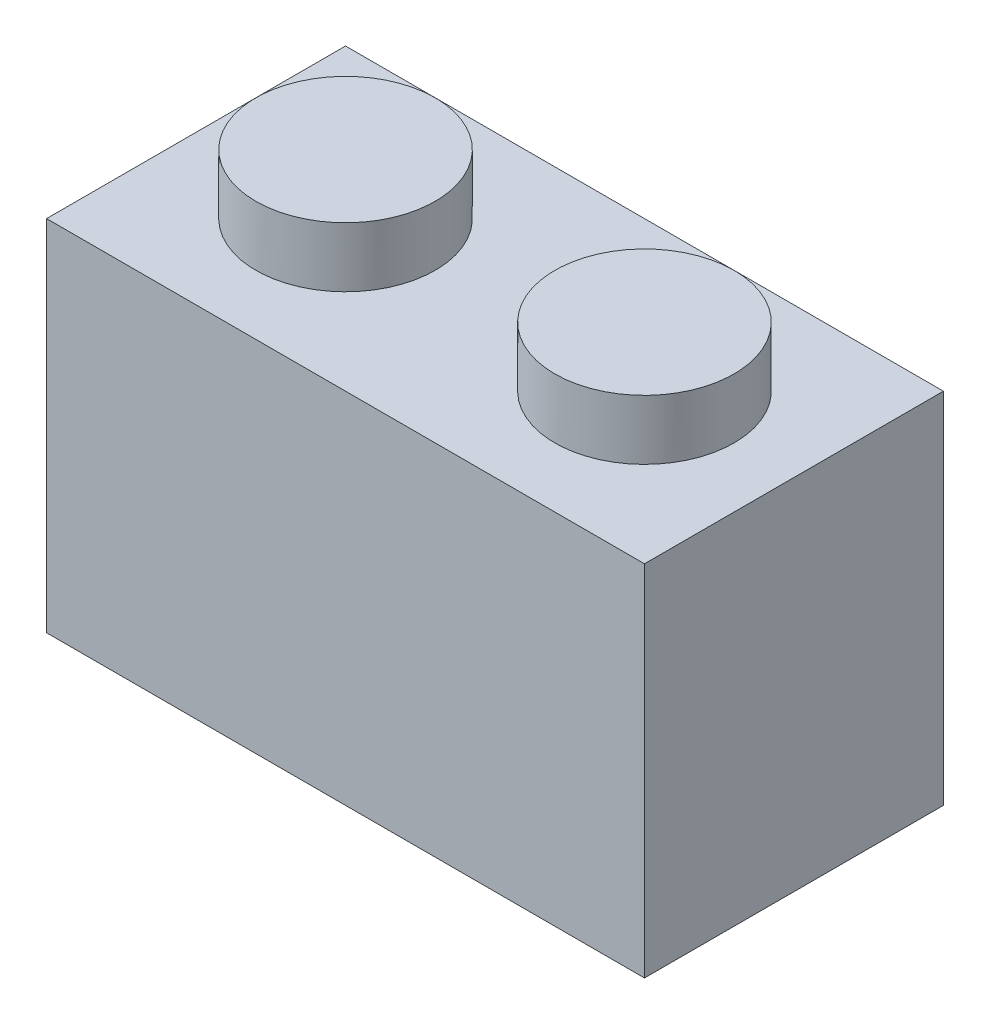
ISO-10303-21;
HEADER;
FILE_DESCRIPTION(('STEP AP214'),'2;1');
FILE_NAME('part.step','',(''),(''),'','','');
FILE_SCHEMA(('AUTOMOTIVE_DESIGN { 1 0 10303 214 1 1 1 1 }'));
ENDSEC;
DATA;
#1=APPLICATION_CONTEXT('core data for automotive mechanical design processes');
#2=APPLICATION_PROTOCOL_DEFINITION('international standard','automotive_design',2000,#1);
#3=PRODUCT_CONTEXT('',#1,'mechanical');
#4=PRODUCT('Part','Part','',(#3));
#5=PRODUCT_RELATED_PRODUCT_CATEGORY('part','',(#4));
#6=PRODUCT_DEFINITION_FORMATION('','',#4);
#7=PRODUCT_DEFINITION_CONTEXT('part definition',#1,'design');
#8=PRODUCT_DEFINITION('design','',#6,#7);
#9=PRODUCT_DEFINITION_SHAPE('','',#8);
#10=(LENGTH_UNIT() NAMED_UNIT(*) SI_UNIT(.MILLI.,.METRE.));
#11=(NAMED_UNIT(*) PLANE_ANGLE_UNIT() SI_UNIT($,.RADIAN.));
#12=(NAMED_UNIT(*) SI_UNIT($,.STERADIAN.) SOLID_ANGLE_UNIT());
#13=UNCERTAINTY_MEASURE_WITH_UNIT(LENGTH_MEASURE(1.E-05),#10,'distance_accuracy_value','');
#14=(GEOMETRIC_REPRESENTATION_CONTEXT(3) GLOBAL_UNCERTAINTY_ASSIGNED_CONTEXT((#13)) GLOBAL_UNIT_ASSIGNED_CONTEXT((#10,
#11,#12)) REPRESENTATION_CONTEXT('',''));
#15=CARTESIAN_POINT('',(0.,0.,0.));
#16=DIRECTION('',(0.,0.,1.));
#17=DIRECTION('',(1.,0.,0.));
#18=AXIS2_PLACEMENT_3D('',#15,#16,#17);
#19=CARTESIAN_POINT('',(-2.5,2.,0.));
#20=DIRECTION('',(0.,-1.,0.));
#21=DIRECTION('',(0.,0.,-1.));
#22=AXIS2_PLACEMENT_3D('',#19,#20,#21);
#23=CYLINDRICAL_SURFACE('',#22,1.5);
#24=CARTESIAN_POINT('',(-2.5,2.,0.));
#25=DIRECTION('',(0.,1.,0.));
#26=DIRECTION('',(0.,0.,1.));
#27=AXIS2_PLACEMENT_3D('',#24,#25,#26);
#28=CIRCLE('',#27,1.5);
#29=CARTESIAN_POINT('',(-2.5,2.,1.5));
#30=VERTEX_POINT('',#29);
#31=EDGE_CURVE('E197',#30,#30,#28,.T.);
#32=ORIENTED_EDGE('',*,*,#31,.F.);
#33=EDGE_LOOP('',(#32));
#34=FACE_BOUND('',#33,.T.);
#35=CARTESIAN_POINT('',(-2.5,1.,0.));
#36=DIRECTION('',(0.,-1.,0.));
#37=DIRECTION('',(0.,0.,-1.));
#38=AXIS2_PLACEMENT_3D('',#35,#36,#37);
#39=CIRCLE('',#38,1.5);
#40=CARTESIAN_POINT('',(-2.5,1.,-1.5));
#41=VERTEX_POINT('',#40);
#42=EDGE_CURVE('E51',#41,#41,#39,.T.);
#43=ORIENTED_EDGE('',*,*,#42,.F.);
#44=EDGE_LOOP('',(#43));
#45=FACE_BOUND('',#44,.T.);
#46=ADVANCED_FACE('F48',(#34,#45),#23,.T.);
#47=CARTESIAN_POINT('',(0.,2.,0.));
#48=DIRECTION('',(0.,1.,0.));
#49=DIRECTION('',(0.,0.,1.));
#50=AXIS2_PLACEMENT_3D('',#47,#48,#49);
#51=PLANE('',#50);
#52=ORIENTED_EDGE('',*,*,#31,.T.);
#53=EDGE_LOOP('',(#52));
#54=FACE_BOUND('',#53,.T.);
#55=ADVANCED_FACE('F212',(#54),#51,.T.);
#56=CARTESIAN_POINT('',(-5.,1.,-2.5));
#57=DIRECTION('',(0.,0.,-1.));
#58=DIRECTION('',(-1.,0.,0.));
#59=AXIS2_PLACEMENT_3D('',#56,#57,#58);
#60=PLANE('',#59);
#61=DIRECTION('',(0.,-1.,0.));
#62=VECTOR('',#61,1.);
#63=CARTESIAN_POINT('',(5.,1.,-2.5));
#64=LINE('',#63,#62);
#65=CARTESIAN_POINT('',(5.,1.,-2.5));
#66=VERTEX_POINT('',#65);
#67=CARTESIAN_POINT('',(5.,-5.,-2.5));
#68=VERTEX_POINT('',#67);
#69=EDGE_CURVE('E194',#66,#68,#64,.T.);
#70=ORIENTED_EDGE('',*,*,#69,.T.);
#71=DIRECTION('',(1.,0.,0.));
#72=VECTOR('',#71,1.);
#73=CARTESIAN_POINT('',(0.,-5.,-2.5));
#74=LINE('',#73,#72);
#75=CARTESIAN_POINT('',(-5.,-5.,-2.5));
#76=VERTEX_POINT('',#75);
#77=EDGE_CURVE('E147',#76,#68,#74,.T.);
#78=ORIENTED_EDGE('',*,*,#77,.F.);
#79=DIRECTION('',(0.,-1.,0.));
#80=VECTOR('',#79,1.);
#81=CARTESIAN_POINT('',(-5.,1.,-2.5));
#82=LINE('',#81,#80);
#83=CARTESIAN_POINT('',(-5.,1.,-2.5));
#84=VERTEX_POINT('',#83);
#85=EDGE_CURVE('E195',#84,#76,#82,.T.);
#86=ORIENTED_EDGE('',*,*,#85,.F.);
#87=DIRECTION('',(1.,0.,0.));
#88=VECTOR('',#87,1.);
#89=CARTESIAN_POINT('',(-5.,1.,-2.5));
#90=LINE('',#89,#88);
#91=EDGE_CURVE('E183',#84,#66,#90,.T.);
#92=ORIENTED_EDGE('',*,*,#91,.T.);
#93=EDGE_LOOP('',(#70,#78,#86,#92));
#94=FACE_BOUND('',#93,.T.);
#95=ADVANCED_FACE('F217',(#94),#60,.T.);
#96=CARTESIAN_POINT('',(-5.,1.,-2.5));
#97=DIRECTION('',(1.,0.,0.));
#98=DIRECTION('',(0.,0.,-1.));
#99=AXIS2_PLACEMENT_3D('',#96,#97,#98);
#100=PLANE('',#99);
#101=ORIENTED_EDGE('',*,*,#85,.T.);
#102=DIRECTION('',(0.,0.,1.));
#103=VECTOR('',#102,1.);
#104=CARTESIAN_POINT('',(-5.,-5.,0.));
#105=LINE('',#104,#103);
#106=CARTESIAN_POINT('',(-5.,-5.,2.5));
#107=VERTEX_POINT('',#106);
#108=EDGE_CURVE('E150',#76,#107,#105,.T.);
#109=ORIENTED_EDGE('',*,*,#108,.T.);
#110=DIRECTION('',(0.,-1.,0.));
#111=VECTOR('',#110,1.);
#112=CARTESIAN_POINT('',(-5.,1.,2.5));
#113=LINE('',#112,#111);
#114=CARTESIAN_POINT('',(-5.,1.,2.5));
#115=VERTEX_POINT('',#114);
#116=EDGE_CURVE('E198',#115,#107,#113,.T.);
#117=ORIENTED_EDGE('',*,*,#116,.F.);
#118=DIRECTION('',(0.,0.,1.));
#119=VECTOR('',#118,1.);
#120=CARTESIAN_POINT('',(-5.,1.,-2.5));
#121=LINE('',#120,#119);
#122=EDGE_CURVE('E192',#84,#115,#121,.T.);
#123=ORIENTED_EDGE('',*,*,#122,.F.);
#124=EDGE_LOOP('',(#101,#109,#117,#123));
#125=FACE_BOUND('',#124,.T.);
#126=ADVANCED_FACE('F223',(#125),#100,.F.);
#127=CARTESIAN_POINT('',(-5.,1.,2.5));
#128=DIRECTION('',(0.,0.,-1.));
#129=DIRECTION('',(-1.,0.,0.));
#130=AXIS2_PLACEMENT_3D('',#127,#128,#129);
#131=PLANE('',#130);
#132=ORIENTED_EDGE('',*,*,#116,.T.);
#133=DIRECTION('',(1.,0.,0.));
#134=VECTOR('',#133,1.);
#135=CARTESIAN_POINT('',(0.,-5.,2.5));
#136=LINE('',#135,#134);
#137=CARTESIAN_POINT('',(5.,-5.,2.5));
#138=VERTEX_POINT('',#137);
#139=EDGE_CURVE('E133',#107,#138,#136,.T.);
#140=ORIENTED_EDGE('',*,*,#139,.T.);
#141=DIRECTION('',(0.,-1.,0.));
#142=VECTOR('',#141,1.);
#143=CARTESIAN_POINT('',(5.,1.,2.5));
#144=LINE('',#143,#142);
#145=CARTESIAN_POINT('',(5.,1.,2.5));
#146=VERTEX_POINT('',#145);
#147=EDGE_CURVE('E200',#146,#138,#144,.T.);
#148=ORIENTED_EDGE('',*,*,#147,.F.);
#149=DIRECTION('',(1.,0.,0.));
#150=VECTOR('',#149,1.);
#151=CARTESIAN_POINT('',(-5.,1.,2.5));
#152=LINE('',#151,#150);
#153=EDGE_CURVE('E190',#115,#146,#152,.T.);
#154=ORIENTED_EDGE('',*,*,#153,.F.);
#155=EDGE_LOOP('',(#132,#140,#148,#154));
#156=FACE_BOUND('',#155,.T.);
#157=ADVANCED_FACE('F291',(#156),#131,.F.);
#158=CARTESIAN_POINT('',(5.,1.,-2.5));
#159=DIRECTION('',(1.,0.,0.));
#160=DIRECTION('',(0.,0.,-1.));
#161=AXIS2_PLACEMENT_3D('',#158,#159,#160);
#162=PLANE('',#161);
#163=ORIENTED_EDGE('',*,*,#147,.T.);
#164=DIRECTION('',(0.,0.,1.));
#165=VECTOR('',#164,1.);
#166=CARTESIAN_POINT('',(5.,-5.,0.));
#167=LINE('',#166,#165);
#168=EDGE_CURVE('E144',#68,#138,#167,.T.);
#169=ORIENTED_EDGE('',*,*,#168,.F.);
#170=ORIENTED_EDGE('',*,*,#69,.F.);
#171=DIRECTION('',(0.,0.,1.));
#172=VECTOR('',#171,1.);
#173=CARTESIAN_POINT('',(5.,1.,-2.5));
#174=LINE('',#173,#172);
#175=EDGE_CURVE('E187',#66,#146,#174,.T.);
#176=ORIENTED_EDGE('',*,*,#175,.T.);
#177=EDGE_LOOP('',(#163,#169,#170,#176));
#178=FACE_BOUND('',#177,.T.);
#179=ADVANCED_FACE('F287',(#178),#162,.T.);
#180=CARTESIAN_POINT('',(0.,1.,0.));
#181=DIRECTION('',(0.,-1.,0.));
#182=DIRECTION('',(0.,0.,-1.));
#183=AXIS2_PLACEMENT_3D('',#180,#181,#182);
#184=PLANE('',#183);
#185=CARTESIAN_POINT('',(2.5,1.,0.));
#186=DIRECTION('',(0.,-1.,0.));
#187=DIRECTION('',(0.,0.,-1.));
#188=AXIS2_PLACEMENT_3D('',#185,#186,#187);
#189=CIRCLE('',#188,1.5);
#190=CARTESIAN_POINT('',(2.5,1.,-1.5));
#191=VERTEX_POINT('',#190);
#192=EDGE_CURVE('E12',#191,#191,#189,.F.);
#193=ORIENTED_EDGE('',*,*,#192,.F.);
#194=EDGE_LOOP('',(#193));
#195=FACE_BOUND('',#194,.T.);
#196=ORIENTED_EDGE('',*,*,#42,.T.);
#197=EDGE_LOOP('',(#196));
#198=FACE_BOUND('',#197,.T.);
#199=ORIENTED_EDGE('',*,*,#91,.F.);
#200=ORIENTED_EDGE('',*,*,#122,.T.);
#201=ORIENTED_EDGE('',*,*,#153,.T.);
#202=ORIENTED_EDGE('',*,*,#175,.F.);
#203=EDGE_LOOP('',(#199,#200,#201,#202));
#204=FACE_BOUND('',#203,.T.);
#205=ADVANCED_FACE('F208',(#195,#198,#204),#184,.F.);
#206=CARTESIAN_POINT('',(2.5,2.,0.));
#207=DIRECTION('',(0.,-1.,0.));
#208=DIRECTION('',(0.,0.,-1.));
#209=AXIS2_PLACEMENT_3D('',#206,#207,#208);
#210=CYLINDRICAL_SURFACE('',#209,1.5);
#211=CARTESIAN_POINT('',(2.5,2.,0.));
#212=DIRECTION('',(0.,1.,0.));
#213=DIRECTION('',(0.,0.,1.));
#214=AXIS2_PLACEMENT_3D('',#211,#212,#213);
#215=CIRCLE('',#214,1.5);
#216=CARTESIAN_POINT('',(2.5,2.,1.5));
#217=VERTEX_POINT('',#216);
#218=EDGE_CURVE('E179',#217,#217,#215,.T.);
#219=ORIENTED_EDGE('',*,*,#218,.F.);
#220=EDGE_LOOP('',(#219));
#221=FACE_BOUND('',#220,.T.);
#222=ORIENTED_EDGE('',*,*,#192,.T.);
#223=EDGE_LOOP('',(#222));
#224=FACE_BOUND('',#223,.T.);
#225=ADVANCED_FACE('F281',(#221,#224),#210,.T.);
#226=CARTESIAN_POINT('',(0.,2.,0.));
#227=DIRECTION('',(0.,1.,0.));
#228=DIRECTION('',(0.,0.,1.));
#229=AXIS2_PLACEMENT_3D('',#226,#227,#228);
#230=PLANE('',#229);
#231=ORIENTED_EDGE('',*,*,#218,.T.);
#232=EDGE_LOOP('',(#231));
#233=FACE_BOUND('',#232,.T.);
#234=ADVANCED_FACE('F254',(#233),#230,.T.);
#235=CARTESIAN_POINT('',(4.,-5.,0.));
#236=DIRECTION('',(1.,0.,0.));
#237=DIRECTION('',(0.,0.,-1.));
#238=AXIS2_PLACEMENT_3D('',#235,#236,#237);
#239=PLANE('',#238);
#240=DIRECTION('',(0.,0.,-1.));
#241=VECTOR('',#240,1.);
#242=CARTESIAN_POINT('',(4.,0.,0.));
#243=LINE('',#242,#241);
#244=CARTESIAN_POINT('',(4.,0.,1.5));
#245=VERTEX_POINT('',#244);
#246=CARTESIAN_POINT('',(4.,0.,-1.5));
#247=VERTEX_POINT('',#246);
#248=EDGE_CURVE('E155',#245,#247,#243,.T.);
#249=ORIENTED_EDGE('',*,*,#248,.T.);
#250=DIRECTION('',(0.,1.,0.));
#251=VECTOR('',#250,1.);
#252=CARTESIAN_POINT('',(4.,-5.,-1.5));
#253=LINE('',#252,#251);
#254=CARTESIAN_POINT('',(4.,-5.,-1.5));
#255=VERTEX_POINT('',#254);
#256=EDGE_CURVE('E136',#255,#247,#253,.T.);
#257=ORIENTED_EDGE('',*,*,#256,.F.);
#258=DIRECTION('',(0.,0.,-1.));
#259=VECTOR('',#258,1.);
#260=CARTESIAN_POINT('',(4.,-5.,0.));
#261=LINE('',#260,#259);
#262=CARTESIAN_POINT('',(4.,-5.,1.5));
#263=VERTEX_POINT('',#262);
#264=EDGE_CURVE('E118',#263,#255,#261,.T.);
#265=ORIENTED_EDGE('',*,*,#264,.F.);
#266=DIRECTION('',(0.,1.,0.));
#267=VECTOR('',#266,1.);
#268=CARTESIAN_POINT('',(4.,-5.,1.5));
#269=LINE('',#268,#267);
#270=EDGE_CURVE('E127',#263,#245,#269,.T.);
#271=ORIENTED_EDGE('',*,*,#270,.T.);
#272=EDGE_LOOP('',(#249,#257,#265,#271));
#273=FACE_BOUND('',#272,.T.);
#274=ADVANCED_FACE('F135',(#273),#239,.F.);
#275=CARTESIAN_POINT('',(0.,-5.,-1.5));
#276=DIRECTION('',(0.,0.,1.));
#277=DIRECTION('',(1.,0.,0.));
#278=AXIS2_PLACEMENT_3D('',#275,#276,#277);
#279=PLANE('',#278);
#280=DIRECTION('',(1.,0.,0.));
#281=VECTOR('',#280,1.);
#282=CARTESIAN_POINT('',(0.,0.,-1.5));
#283=LINE('',#282,#281);
#284=CARTESIAN_POINT('',(-4.,0.,-1.5));
#285=VERTEX_POINT('',#284);
#286=EDGE_CURVE('E63',#285,#247,#283,.T.);
#287=ORIENTED_EDGE('',*,*,#286,.F.);
#288=DIRECTION('',(0.,1.,0.));
#289=VECTOR('',#288,1.);
#290=CARTESIAN_POINT('',(-4.,-5.,-1.5));
#291=LINE('',#290,#289);
#292=CARTESIAN_POINT('',(-4.,-5.,-1.5));
#293=VERTEX_POINT('',#292);
#294=EDGE_CURVE('E161',#293,#285,#291,.T.);
#295=ORIENTED_EDGE('',*,*,#294,.F.);
#296=DIRECTION('',(1.,0.,0.));
#297=VECTOR('',#296,1.);
#298=CARTESIAN_POINT('',(0.,-5.,-1.5));
#299=LINE('',#298,#297);
#300=EDGE_CURVE('E142',#293,#255,#299,.T.);
#301=ORIENTED_EDGE('',*,*,#300,.T.);
#302=ORIENTED_EDGE('',*,*,#256,.T.);
#303=EDGE_LOOP('',(#287,#295,#301,#302));
#304=FACE_BOUND('',#303,.T.);
#305=ADVANCED_FACE('F246',(#304),#279,.T.);
#306=CARTESIAN_POINT('',(-4.,-5.,0.));
#307=DIRECTION('',(1.,0.,0.));
#308=DIRECTION('',(0.,0.,-1.));
#309=AXIS2_PLACEMENT_3D('',#306,#307,#308);
#310=PLANE('',#309);
#311=DIRECTION('',(0.,0.,-1.));
#312=VECTOR('',#311,1.);
#313=CARTESIAN_POINT('',(-4.,0.,0.));
#314=LINE('',#313,#312);
#315=CARTESIAN_POINT('',(-4.,0.,1.5));
#316=VERTEX_POINT('',#315);
#317=EDGE_CURVE('E68',#316,#285,#314,.T.);
#318=ORIENTED_EDGE('',*,*,#317,.F.);
#319=DIRECTION('',(0.,1.,0.));
#320=VECTOR('',#319,1.);
#321=CARTESIAN_POINT('',(-4.,-5.,1.5));
#322=LINE('',#321,#320);
#323=CARTESIAN_POINT('',(-4.,-5.,1.5));
#324=VERTEX_POINT('',#323);
#325=EDGE_CURVE('E132',#324,#316,#322,.T.);
#326=ORIENTED_EDGE('',*,*,#325,.F.);
#327=DIRECTION('',(0.,0.,-1.));
#328=VECTOR('',#327,1.);
#329=CARTESIAN_POINT('',(-4.,-5.,0.));
#330=LINE('',#329,#328);
#331=EDGE_CURVE('E121',#324,#293,#330,.T.);
#332=ORIENTED_EDGE('',*,*,#331,.T.);
#333=ORIENTED_EDGE('',*,*,#294,.T.);
#334=EDGE_LOOP('',(#318,#326,#332,#333));
#335=FACE_BOUND('',#334,.T.);
#336=ADVANCED_FACE('F244',(#335),#310,.T.);
#337=CARTESIAN_POINT('',(0.,-5.,1.5));
#338=DIRECTION('',(0.,0.,1.));
#339=DIRECTION('',(1.,0.,0.));
#340=AXIS2_PLACEMENT_3D('',#337,#338,#339);
#341=PLANE('',#340);
#342=DIRECTION('',(1.,0.,0.));
#343=VECTOR('',#342,1.);
#344=CARTESIAN_POINT('',(0.,0.,1.5));
#345=LINE('',#344,#343);
#346=EDGE_CURVE('E129',#316,#245,#345,.T.);
#347=ORIENTED_EDGE('',*,*,#346,.T.);
#348=ORIENTED_EDGE('',*,*,#270,.F.);
#349=DIRECTION('',(1.,0.,0.));
#350=VECTOR('',#349,1.);
#351=CARTESIAN_POINT('',(0.,-5.,1.5));
#352=LINE('',#351,#350);
#353=EDGE_CURVE('E112',#324,#263,#352,.T.);
#354=ORIENTED_EDGE('',*,*,#353,.F.);
#355=ORIENTED_EDGE('',*,*,#325,.T.);
#356=EDGE_LOOP('',(#347,#348,#354,#355));
#357=FACE_BOUND('',#356,.T.);
#358=ADVANCED_FACE('F128',(#357),#341,.F.);
#359=CARTESIAN_POINT('',(0.,-5.,0.));
#360=DIRECTION('',(0.,1.,0.));
#361=DIRECTION('',(0.,0.,1.));
#362=AXIS2_PLACEMENT_3D('',#359,#360,#361);
#363=PLANE('',#362);
#364=ORIENTED_EDGE('',*,*,#264,.T.);
#365=ORIENTED_EDGE('',*,*,#300,.F.);
#366=ORIENTED_EDGE('',*,*,#331,.F.);
#367=ORIENTED_EDGE('',*,*,#353,.T.);
#368=EDGE_LOOP('',(#364,#365,#366,#367));
#369=FACE_BOUND('',#368,.T.);
#370=ORIENTED_EDGE('',*,*,#168,.T.);
#371=ORIENTED_EDGE('',*,*,#139,.F.);
#372=ORIENTED_EDGE('',*,*,#108,.F.);
#373=ORIENTED_EDGE('',*,*,#77,.T.);
#374=EDGE_LOOP('',(#370,#371,#372,#373));
#375=FACE_BOUND('',#374,.T.);
#376=ADVANCED_FACE('F114',(#369,#375),#363,.F.);
#377=CARTESIAN_POINT('',(0.,-5.,0.));
#378=DIRECTION('',(0.,1.,0.));
#379=DIRECTION('',(0.,0.,1.));
#380=AXIS2_PLACEMENT_3D('',#377,#378,#379);
#381=PLANE('',#380);
#382=CARTESIAN_POINT('',(0.,-5.,0.));
#383=DIRECTION('',(0.,1.,0.));
#384=DIRECTION('',(0.,0.,1.));
#385=AXIS2_PLACEMENT_3D('',#382,#383,#384);
#386=CIRCLE('',#385,0.999999999999998);
#387=CARTESIAN_POINT('',(0.,-5.,0.999999999999999));
#388=VERTEX_POINT('',#387);
#389=EDGE_CURVE('E164',#388,#388,#386,.T.);
#390=ORIENTED_EDGE('',*,*,#389,.F.);
#391=EDGE_LOOP('',(#390));
#392=FACE_BOUND('',#391,.T.);
#393=ADVANCED_FACE('F260',(#392),#381,.F.);
#394=CARTESIAN_POINT('',(0.,1.,0.));
#395=DIRECTION('',(0.,1.,0.));
#396=DIRECTION('',(0.,0.,1.));
#397=AXIS2_PLACEMENT_3D('',#394,#395,#396);
#398=PLANE('',#397);
#399=CARTESIAN_POINT('',(2.5,1.,0.));
#400=DIRECTION('',(0.,1.,0.));
#401=DIRECTION('',(0.,0.,1.));
#402=AXIS2_PLACEMENT_3D('',#399,#400,#401);
#403=CIRCLE('',#402,0.75);
#404=CARTESIAN_POINT('',(2.5,1.,0.750000000000001));
#405=VERTEX_POINT('',#404);
#406=EDGE_CURVE('E170',#405,#405,#403,.T.);
#407=ORIENTED_EDGE('',*,*,#406,.F.);
#408=EDGE_LOOP('',(#407));
#409=FACE_BOUND('',#408,.T.);
#410=ADVANCED_FACE('F263',(#409),#398,.F.);
#411=CARTESIAN_POINT('',(0.,1.,0.));
#412=DIRECTION('',(0.,1.,0.));
#413=DIRECTION('',(0.,0.,1.));
#414=AXIS2_PLACEMENT_3D('',#411,#412,#413);
#415=PLANE('',#414);
#416=CARTESIAN_POINT('',(-2.5,1.,0.));
#417=DIRECTION('',(0.,1.,0.));
#418=DIRECTION('',(0.,0.,1.));
#419=AXIS2_PLACEMENT_3D('',#416,#417,#418);
#420=CIRCLE('',#419,0.75);
#421=CARTESIAN_POINT('',(-2.5,1.,0.75));
#422=VERTEX_POINT('',#421);
#423=EDGE_CURVE('E176',#422,#422,#420,.T.);
#424=ORIENTED_EDGE('',*,*,#423,.F.);
#425=EDGE_LOOP('',(#424));
#426=FACE_BOUND('',#425,.T.);
#427=ADVANCED_FACE('F268',(#426),#415,.F.);
#428=CARTESIAN_POINT('',(0.,-5.,0.));
#429=DIRECTION('',(0.,1.,0.));
#430=DIRECTION('',(0.,0.,1.));
#431=AXIS2_PLACEMENT_3D('',#428,#429,#430);
#432=CYLINDRICAL_SURFACE('',#431,0.999999999999998);
#433=ORIENTED_EDGE('',*,*,#389,.T.);
#434=EDGE_LOOP('',(#433));
#435=FACE_BOUND('',#434,.T.);
#436=CARTESIAN_POINT('',(0.,0.,0.));
#437=DIRECTION('',(0.,1.,0.));
#438=DIRECTION('',(0.,0.,1.));
#439=AXIS2_PLACEMENT_3D('',#436,#437,#438);
#440=CIRCLE('',#439,0.999999999999998);
#441=CARTESIAN_POINT('',(0.,0.,0.999999999999999));
#442=VERTEX_POINT('',#441);
#443=EDGE_CURVE('E160',#442,#442,#440,.T.);
#444=ORIENTED_EDGE('',*,*,#443,.F.);
#445=EDGE_LOOP('',(#444));
#446=FACE_BOUND('',#445,.T.);
#447=ADVANCED_FACE('F265',(#435,#446),#432,.T.);
#448=CARTESIAN_POINT('',(2.5,1.,0.));
#449=DIRECTION('',(0.,-1.,0.));
#450=DIRECTION('',(0.,0.,-1.));
#451=AXIS2_PLACEMENT_3D('',#448,#449,#450);
#452=CYLINDRICAL_SURFACE('',#451,0.75);
#453=ORIENTED_EDGE('',*,*,#406,.T.);
#454=EDGE_LOOP('',(#453));
#455=FACE_BOUND('',#454,.T.);
#456=CARTESIAN_POINT('',(2.5,0.,0.));
#457=DIRECTION('',(0.,1.,0.));
#458=DIRECTION('',(0.,0.,1.));
#459=AXIS2_PLACEMENT_3D('',#456,#457,#458);
#460=CIRCLE('',#459,0.75);
#461=CARTESIAN_POINT('',(2.5,0.,0.750000000000001));
#462=VERTEX_POINT('',#461);
#463=EDGE_CURVE('E167',#462,#462,#460,.T.);
#464=ORIENTED_EDGE('',*,*,#463,.F.);
#465=EDGE_LOOP('',(#464));
#466=FACE_BOUND('',#465,.T.);
#467=ADVANCED_FACE('F235',(#455,#466),#452,.F.);
#468=CARTESIAN_POINT('',(-2.5,1.,0.));
#469=DIRECTION('',(0.,-1.,0.));
#470=DIRECTION('',(0.,0.,-1.));
#471=AXIS2_PLACEMENT_3D('',#468,#469,#470);
#472=CYLINDRICAL_SURFACE('',#471,0.75);
#473=ORIENTED_EDGE('',*,*,#423,.T.);
#474=EDGE_LOOP('',(#473));
#475=FACE_BOUND('',#474,.T.);
#476=CARTESIAN_POINT('',(-2.5,0.,0.));
#477=DIRECTION('',(0.,1.,0.));
#478=DIRECTION('',(0.,0.,1.));
#479=AXIS2_PLACEMENT_3D('',#476,#477,#478);
#480=CIRCLE('',#479,0.75);
#481=CARTESIAN_POINT('',(-2.5,0.,0.75));
#482=VERTEX_POINT('',#481);
#483=EDGE_CURVE('E173',#482,#482,#480,.T.);
#484=ORIENTED_EDGE('',*,*,#483,.F.);
#485=EDGE_LOOP('',(#484));
#486=FACE_BOUND('',#485,.T.);
#487=ADVANCED_FACE('F229',(#475,#486),#472,.F.);
#488=CARTESIAN_POINT('',(0.,0.,0.));
#489=DIRECTION('',(0.,1.,0.));
#490=DIRECTION('',(0.,0.,1.));
#491=AXIS2_PLACEMENT_3D('',#488,#489,#490);
#492=PLANE('',#491);
#493=ORIENTED_EDGE('',*,*,#483,.T.);
#494=EDGE_LOOP('',(#493));
#495=FACE_BOUND('',#494,.T.);
#496=ORIENTED_EDGE('',*,*,#463,.T.);
#497=EDGE_LOOP('',(#496));
#498=FACE_BOUND('',#497,.T.);
#499=ORIENTED_EDGE('',*,*,#443,.T.);
#500=EDGE_LOOP('',(#499));
#501=FACE_BOUND('',#500,.T.);
#502=ORIENTED_EDGE('',*,*,#248,.F.);
#503=ORIENTED_EDGE('',*,*,#346,.F.);
#504=ORIENTED_EDGE('',*,*,#317,.T.);
#505=ORIENTED_EDGE('',*,*,#286,.T.);
#506=EDGE_LOOP('',(#502,#503,#504,#505));
#507=FACE_BOUND('',#506,.T.);
#508=ADVANCED_FACE('F227',(#495,#498,#501,#507),#492,.F.);
#509=CLOSED_SHELL('',(#46,#55,#95,#126,#157,#179,#205,#225,#234,#274,#305,#336,#358,#376,#393,
#410,#427,#447,#467,#487,#508));
#510=MANIFOLD_SOLID_BREP('B2',#509);
#511=ADVANCED_BREP_SHAPE_REPRESENTATION('',(#18,#510),#14);
#512=SHAPE_DEFINITION_REPRESENTATION(#9,#511);
ENDSEC;
END-ISO-10303-21;
